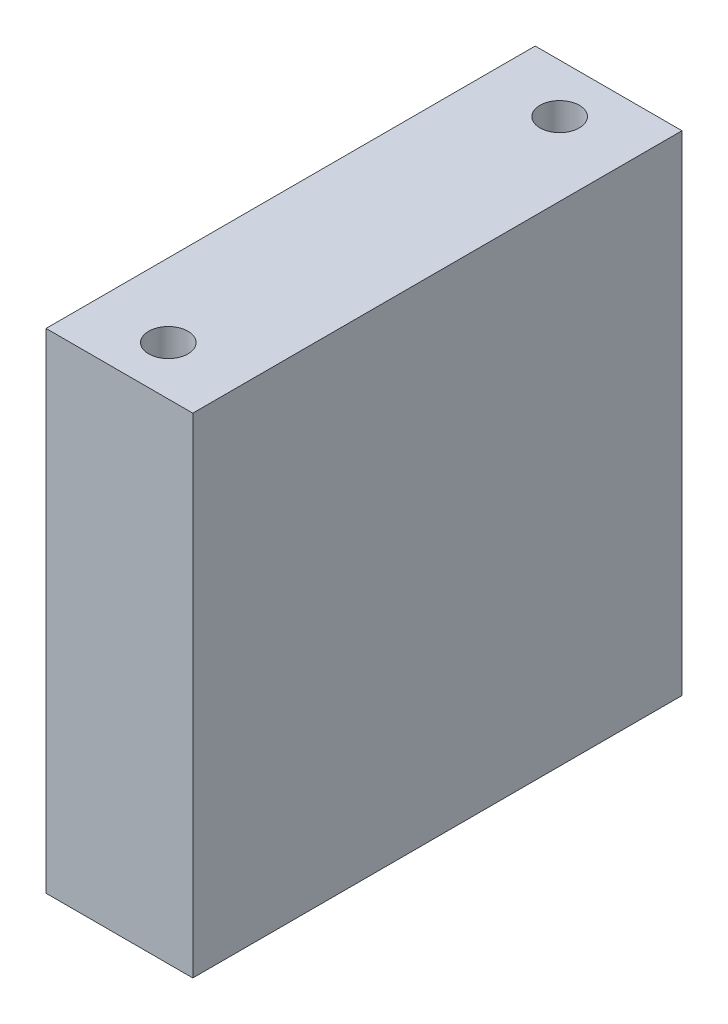
ISO-10303-21;
HEADER;
FILE_DESCRIPTION(('STEP AP214'),'2;1');
FILE_NAME('part.step','',(''),(''),'','','');
FILE_SCHEMA(('AUTOMOTIVE_DESIGN { 1 0 10303 214 1 1 1 1 }'));
ENDSEC;
DATA;
#1=APPLICATION_CONTEXT('core data for automotive mechanical design processes');
#2=APPLICATION_PROTOCOL_DEFINITION('international standard','automotive_design',2000,#1);
#3=PRODUCT_CONTEXT('',#1,'mechanical');
#4=PRODUCT('Part','Part','',(#3));
#5=PRODUCT_RELATED_PRODUCT_CATEGORY('part','',(#4));
#6=PRODUCT_DEFINITION_FORMATION('','',#4);
#7=PRODUCT_DEFINITION_CONTEXT('part definition',#1,'design');
#8=PRODUCT_DEFINITION('design','',#6,#7);
#9=PRODUCT_DEFINITION_SHAPE('','',#8);
#10=(LENGTH_UNIT() NAMED_UNIT(*) SI_UNIT(.MILLI.,.METRE.));
#11=(NAMED_UNIT(*) PLANE_ANGLE_UNIT() SI_UNIT($,.RADIAN.));
#12=(NAMED_UNIT(*) SI_UNIT($,.STERADIAN.) SOLID_ANGLE_UNIT());
#13=UNCERTAINTY_MEASURE_WITH_UNIT(LENGTH_MEASURE(1.E-05),#10,'distance_accuracy_value','');
#14=(GEOMETRIC_REPRESENTATION_CONTEXT(3) GLOBAL_UNCERTAINTY_ASSIGNED_CONTEXT((#13)) GLOBAL_UNIT_ASSIGNED_CONTEXT((#10,
#11,#12)) REPRESENTATION_CONTEXT('',''));
#15=CARTESIAN_POINT('',(0.,0.,0.));
#16=DIRECTION('',(0.,0.,1.));
#17=DIRECTION('',(1.,0.,0.));
#18=AXIS2_PLACEMENT_3D('',#15,#16,#17);
#19=CARTESIAN_POINT('',(-9.525,63.5,31.75));
#20=DIRECTION('',(1.,0.,0.));
#21=DIRECTION('',(0.,0.,-1.));
#22=AXIS2_PLACEMENT_3D('',#19,#20,#21);
#23=PLANE('',#22);
#24=DIRECTION('',(0.,0.,1.));
#25=VECTOR('',#24,1.);
#26=CARTESIAN_POINT('',(-9.525,0.,31.75));
#27=LINE('',#26,#25);
#28=CARTESIAN_POINT('',(-9.525,0.,-31.75));
#29=VERTEX_POINT('',#28);
#30=CARTESIAN_POINT('',(-9.525,0.,31.75));
#31=VERTEX_POINT('',#30);
#32=EDGE_CURVE('E134',#29,#31,#27,.T.);
#33=ORIENTED_EDGE('',*,*,#32,.T.);
#34=DIRECTION('',(0.,-1.,0.));
#35=VECTOR('',#34,1.);
#36=CARTESIAN_POINT('',(-9.525,63.5,31.75));
#37=LINE('',#36,#35);
#38=CARTESIAN_POINT('',(-9.525,63.5,31.75));
#39=VERTEX_POINT('',#38);
#40=EDGE_CURVE('E11',#39,#31,#37,.T.);
#41=ORIENTED_EDGE('',*,*,#40,.F.);
#42=DIRECTION('',(0.,0.,1.));
#43=VECTOR('',#42,1.);
#44=CARTESIAN_POINT('',(-9.525,63.5,31.75));
#45=LINE('',#44,#43);
#46=CARTESIAN_POINT('',(-9.525,63.5,-31.75));
#47=VERTEX_POINT('',#46);
#48=EDGE_CURVE('E135',#47,#39,#45,.T.);
#49=ORIENTED_EDGE('',*,*,#48,.F.);
#50=DIRECTION('',(0.,-1.,0.));
#51=VECTOR('',#50,1.);
#52=CARTESIAN_POINT('',(-9.525,63.5,-31.75));
#53=LINE('',#52,#51);
#54=EDGE_CURVE('E141',#47,#29,#53,.T.);
#55=ORIENTED_EDGE('',*,*,#54,.T.);
#56=EDGE_LOOP('',(#33,#41,#49,#55));
#57=FACE_BOUND('',#56,.T.);
#58=ADVANCED_FACE('F41',(#57),#23,.F.);
#59=CARTESIAN_POINT('',(9.525,63.5,31.75));
#60=DIRECTION('',(0.,0.,-1.));
#61=DIRECTION('',(-1.,0.,0.));
#62=AXIS2_PLACEMENT_3D('',#59,#60,#61);
#63=PLANE('',#62);
#64=DIRECTION('',(1.,0.,0.));
#65=VECTOR('',#64,1.);
#66=CARTESIAN_POINT('',(9.525,0.,31.75));
#67=LINE('',#66,#65);
#68=CARTESIAN_POINT('',(9.525,0.,31.75));
#69=VERTEX_POINT('',#68);
#70=EDGE_CURVE('E144',#31,#69,#67,.T.);
#71=ORIENTED_EDGE('',*,*,#70,.T.);
#72=DIRECTION('',(0.,-1.,0.));
#73=VECTOR('',#72,1.);
#74=CARTESIAN_POINT('',(9.525,63.5,31.75));
#75=LINE('',#74,#73);
#76=CARTESIAN_POINT('',(9.525,63.5,31.75));
#77=VERTEX_POINT('',#76);
#78=EDGE_CURVE('E49',#77,#69,#75,.T.);
#79=ORIENTED_EDGE('',*,*,#78,.F.);
#80=DIRECTION('',(1.,0.,0.));
#81=VECTOR('',#80,1.);
#82=CARTESIAN_POINT('',(9.525,63.5,31.75));
#83=LINE('',#82,#81);
#84=EDGE_CURVE('E88',#39,#77,#83,.T.);
#85=ORIENTED_EDGE('',*,*,#84,.F.);
#86=ORIENTED_EDGE('',*,*,#40,.T.);
#87=EDGE_LOOP('',(#71,#79,#85,#86));
#88=FACE_BOUND('',#87,.T.);
#89=ADVANCED_FACE('F169',(#88),#63,.F.);
#90=CARTESIAN_POINT('',(9.525,63.5,31.75));
#91=DIRECTION('',(-1.,0.,0.));
#92=DIRECTION('',(0.,0.,1.));
#93=AXIS2_PLACEMENT_3D('',#90,#91,#92);
#94=PLANE('',#93);
#95=DIRECTION('',(0.,0.,-1.));
#96=VECTOR('',#95,1.);
#97=CARTESIAN_POINT('',(9.525,0.,31.75));
#98=LINE('',#97,#96);
#99=CARTESIAN_POINT('',(9.525,0.,-31.75));
#100=VERTEX_POINT('',#99);
#101=EDGE_CURVE('E75',#69,#100,#98,.T.);
#102=ORIENTED_EDGE('',*,*,#101,.T.);
#103=DIRECTION('',(0.,-1.,0.));
#104=VECTOR('',#103,1.);
#105=CARTESIAN_POINT('',(9.525,63.5,-31.75));
#106=LINE('',#105,#104);
#107=CARTESIAN_POINT('',(9.525,63.5,-31.75));
#108=VERTEX_POINT('',#107);
#109=EDGE_CURVE('E149',#108,#100,#106,.T.);
#110=ORIENTED_EDGE('',*,*,#109,.F.);
#111=DIRECTION('',(0.,0.,-1.));
#112=VECTOR('',#111,1.);
#113=CARTESIAN_POINT('',(9.525,63.5,31.75));
#114=LINE('',#113,#112);
#115=EDGE_CURVE('E138',#77,#108,#114,.T.);
#116=ORIENTED_EDGE('',*,*,#115,.F.);
#117=ORIENTED_EDGE('',*,*,#78,.T.);
#118=EDGE_LOOP('',(#102,#110,#116,#117));
#119=FACE_BOUND('',#118,.T.);
#120=ADVANCED_FACE('F151',(#119),#94,.F.);
#121=CARTESIAN_POINT('',(9.525,63.5,-31.75));
#122=DIRECTION('',(0.,0.,1.));
#123=DIRECTION('',(1.,0.,0.));
#124=AXIS2_PLACEMENT_3D('',#121,#122,#123);
#125=PLANE('',#124);
#126=DIRECTION('',(-1.,0.,0.));
#127=VECTOR('',#126,1.);
#128=CARTESIAN_POINT('',(9.525,0.,-31.75));
#129=LINE('',#128,#127);
#130=EDGE_CURVE('E81',#100,#29,#129,.T.);
#131=ORIENTED_EDGE('',*,*,#130,.T.);
#132=ORIENTED_EDGE('',*,*,#54,.F.);
#133=DIRECTION('',(-1.,0.,0.));
#134=VECTOR('',#133,1.);
#135=CARTESIAN_POINT('',(9.525,63.5,-31.75));
#136=LINE('',#135,#134);
#137=EDGE_CURVE('E57',#108,#47,#136,.T.);
#138=ORIENTED_EDGE('',*,*,#137,.F.);
#139=ORIENTED_EDGE('',*,*,#109,.T.);
#140=EDGE_LOOP('',(#131,#132,#138,#139));
#141=FACE_BOUND('',#140,.T.);
#142=ADVANCED_FACE('F158',(#141),#125,.F.);
#143=CARTESIAN_POINT('',(0.,63.5,0.));
#144=DIRECTION('',(0.,1.,0.));
#145=DIRECTION('',(0.,0.,1.));
#146=AXIS2_PLACEMENT_3D('',#143,#144,#145);
#147=PLANE('',#146);
#148=CARTESIAN_POINT('',(0.,63.5,-25.4));
#149=DIRECTION('',(0.,1.,0.));
#150=DIRECTION('',(0.,0.,1.));
#151=AXIS2_PLACEMENT_3D('',#148,#149,#150);
#152=CIRCLE('',#151,2.55269999999999);
#153=CARTESIAN_POINT('',(0.,63.5,-22.8473));
#154=VERTEX_POINT('',#153);
#155=EDGE_CURVE('E112',#154,#154,#152,.T.);
#156=ORIENTED_EDGE('',*,*,#155,.F.);
#157=EDGE_LOOP('',(#156));
#158=FACE_BOUND('',#157,.T.);
#159=CARTESIAN_POINT('',(0.,63.5,25.4));
#160=DIRECTION('',(0.,1.,0.));
#161=DIRECTION('',(0.,0.,1.));
#162=AXIS2_PLACEMENT_3D('',#159,#160,#161);
#163=CIRCLE('',#162,2.55269999999999);
#164=CARTESIAN_POINT('',(0.,63.5,27.9527));
#165=VERTEX_POINT('',#164);
#166=EDGE_CURVE('E111',#165,#165,#163,.T.);
#167=ORIENTED_EDGE('',*,*,#166,.F.);
#168=EDGE_LOOP('',(#167));
#169=FACE_BOUND('',#168,.T.);
#170=ORIENTED_EDGE('',*,*,#48,.T.);
#171=ORIENTED_EDGE('',*,*,#84,.T.);
#172=ORIENTED_EDGE('',*,*,#115,.T.);
#173=ORIENTED_EDGE('',*,*,#137,.T.);
#174=EDGE_LOOP('',(#170,#171,#172,#173));
#175=FACE_BOUND('',#174,.T.);
#176=ADVANCED_FACE('F160',(#158,#169,#175),#147,.T.);
#177=CARTESIAN_POINT('',(0.,0.,0.));
#178=DIRECTION('',(0.,1.,0.));
#179=DIRECTION('',(0.,0.,1.));
#180=AXIS2_PLACEMENT_3D('',#177,#178,#179);
#181=PLANE('',#180);
#182=CARTESIAN_POINT('',(0.,0.,25.4));
#183=DIRECTION('',(0.,-1.,0.));
#184=DIRECTION('',(0.,0.,-1.));
#185=AXIS2_PLACEMENT_3D('',#182,#183,#184);
#186=CIRCLE('',#185,2.55269999999999);
#187=CARTESIAN_POINT('',(0.,0.,22.8473));
#188=VERTEX_POINT('',#187);
#189=EDGE_CURVE('E122',#188,#188,#186,.T.);
#190=ORIENTED_EDGE('',*,*,#189,.F.);
#191=EDGE_LOOP('',(#190));
#192=FACE_BOUND('',#191,.T.);
#193=CARTESIAN_POINT('',(0.,0.,-25.4));
#194=DIRECTION('',(0.,-1.,0.));
#195=DIRECTION('',(0.,0.,-1.));
#196=AXIS2_PLACEMENT_3D('',#193,#194,#195);
#197=CIRCLE('',#196,2.55269999999999);
#198=CARTESIAN_POINT('',(0.,0.,-27.9527));
#199=VERTEX_POINT('',#198);
#200=EDGE_CURVE('E128',#199,#199,#197,.T.);
#201=ORIENTED_EDGE('',*,*,#200,.F.);
#202=EDGE_LOOP('',(#201));
#203=FACE_BOUND('',#202,.T.);
#204=ORIENTED_EDGE('',*,*,#32,.F.);
#205=ORIENTED_EDGE('',*,*,#130,.F.);
#206=ORIENTED_EDGE('',*,*,#101,.F.);
#207=ORIENTED_EDGE('',*,*,#70,.F.);
#208=EDGE_LOOP('',(#204,#205,#206,#207));
#209=FACE_BOUND('',#208,.T.);
#210=ADVANCED_FACE('F154',(#192,#203,#209),#181,.F.);
#211=CARTESIAN_POINT('',(0.,16.51,-25.4));
#212=DIRECTION('',(0.,-1.,0.));
#213=DIRECTION('',(0.,0.,-1.));
#214=AXIS2_PLACEMENT_3D('',#211,#212,#213);
#215=CONICAL_SURFACE('',#214,2.55269999999999,1.02974425867665);
#216=CARTESIAN_POINT('',(0.,18.0438169021916,-25.4));
#217=VERTEX_POINT('',#216);
#218=VERTEX_LOOP('',#217);
#219=FACE_BOUND('',#218,.T.);
#220=CARTESIAN_POINT('',(0.,16.51,-25.4));
#221=DIRECTION('',(0.,-1.,0.));
#222=DIRECTION('',(0.,0.,-1.));
#223=AXIS2_PLACEMENT_3D('',#220,#221,#222);
#224=CIRCLE('',#223,2.55269999999999);
#225=CARTESIAN_POINT('',(0.,16.51,-27.9527));
#226=VERTEX_POINT('',#225);
#227=EDGE_CURVE('E131',#226,#226,#224,.T.);
#228=ORIENTED_EDGE('',*,*,#227,.T.);
#229=EDGE_LOOP('',(#228));
#230=FACE_BOUND('',#229,.T.);
#231=ADVANCED_FACE('F197',(#219,#230),#215,.F.);
#232=CARTESIAN_POINT('',(0.,0.,-25.4));
#233=DIRECTION('',(0.,-1.,0.));
#234=DIRECTION('',(0.,0.,-1.));
#235=AXIS2_PLACEMENT_3D('',#232,#233,#234);
#236=CYLINDRICAL_SURFACE('',#235,2.55269999999999);
#237=ORIENTED_EDGE('',*,*,#227,.F.);
#238=EDGE_LOOP('',(#237));
#239=FACE_BOUND('',#238,.T.);
#240=ORIENTED_EDGE('',*,*,#200,.T.);
#241=EDGE_LOOP('',(#240));
#242=FACE_BOUND('',#241,.T.);
#243=ADVANCED_FACE('F208',(#239,#242),#236,.F.);
#244=CARTESIAN_POINT('',(0.,16.51,25.4));
#245=DIRECTION('',(0.,-1.,0.));
#246=DIRECTION('',(0.,0.,-1.));
#247=AXIS2_PLACEMENT_3D('',#244,#245,#246);
#248=CONICAL_SURFACE('',#247,2.55269999999999,1.02974425867665);
#249=CARTESIAN_POINT('',(0.,18.0438169021916,25.4));
#250=VERTEX_POINT('',#249);
#251=VERTEX_LOOP('',#250);
#252=FACE_BOUND('',#251,.T.);
#253=CARTESIAN_POINT('',(0.,16.51,25.4));
#254=DIRECTION('',(0.,-1.,0.));
#255=DIRECTION('',(0.,0.,-1.));
#256=AXIS2_PLACEMENT_3D('',#253,#254,#255);
#257=CIRCLE('',#256,2.55269999999999);
#258=CARTESIAN_POINT('',(0.,16.51,22.8473));
#259=VERTEX_POINT('',#258);
#260=EDGE_CURVE('E125',#259,#259,#257,.T.);
#261=ORIENTED_EDGE('',*,*,#260,.T.);
#262=EDGE_LOOP('',(#261));
#263=FACE_BOUND('',#262,.T.);
#264=ADVANCED_FACE('F220',(#252,#263),#248,.F.);
#265=CARTESIAN_POINT('',(0.,0.,25.4));
#266=DIRECTION('',(0.,-1.,0.));
#267=DIRECTION('',(0.,0.,-1.));
#268=AXIS2_PLACEMENT_3D('',#265,#266,#267);
#269=CYLINDRICAL_SURFACE('',#268,2.55269999999999);
#270=ORIENTED_EDGE('',*,*,#260,.F.);
#271=EDGE_LOOP('',(#270));
#272=FACE_BOUND('',#271,.T.);
#273=ORIENTED_EDGE('',*,*,#189,.T.);
#274=EDGE_LOOP('',(#273));
#275=FACE_BOUND('',#274,.T.);
#276=ADVANCED_FACE('F232',(#272,#275),#269,.F.);
#277=CARTESIAN_POINT('',(0.,46.99,25.4));
#278=DIRECTION('',(0.,1.,0.));
#279=DIRECTION('',(0.,0.,1.));
#280=AXIS2_PLACEMENT_3D('',#277,#278,#279);
#281=CONICAL_SURFACE('',#280,2.55269999999999,1.02974425867665);
#282=CARTESIAN_POINT('',(0.,45.4561830978084,25.4));
#283=VERTEX_POINT('',#282);
#284=VERTEX_LOOP('',#283);
#285=FACE_BOUND('',#284,.T.);
#286=CARTESIAN_POINT('',(0.,46.99,25.4));
#287=DIRECTION('',(0.,1.,0.));
#288=DIRECTION('',(0.,0.,1.));
#289=AXIS2_PLACEMENT_3D('',#286,#287,#288);
#290=CIRCLE('',#289,2.55269999999999);
#291=CARTESIAN_POINT('',(0.,46.99,27.9527));
#292=VERTEX_POINT('',#291);
#293=EDGE_CURVE('E115',#292,#292,#290,.T.);
#294=ORIENTED_EDGE('',*,*,#293,.T.);
#295=EDGE_LOOP('',(#294));
#296=FACE_BOUND('',#295,.T.);
#297=ADVANCED_FACE('F243',(#285,#296),#281,.F.);
#298=CARTESIAN_POINT('',(0.,63.5,25.4));
#299=DIRECTION('',(0.,1.,0.));
#300=DIRECTION('',(0.,0.,1.));
#301=AXIS2_PLACEMENT_3D('',#298,#299,#300);
#302=CYLINDRICAL_SURFACE('',#301,2.55269999999999);
#303=ORIENTED_EDGE('',*,*,#293,.F.);
#304=EDGE_LOOP('',(#303));
#305=FACE_BOUND('',#304,.T.);
#306=ORIENTED_EDGE('',*,*,#166,.T.);
#307=EDGE_LOOP('',(#306));
#308=FACE_BOUND('',#307,.T.);
#309=ADVANCED_FACE('F105',(#305,#308),#302,.F.);
#310=CARTESIAN_POINT('',(0.,46.99,-25.4));
#311=DIRECTION('',(0.,1.,0.));
#312=DIRECTION('',(0.,0.,1.));
#313=AXIS2_PLACEMENT_3D('',#310,#311,#312);
#314=CONICAL_SURFACE('',#313,2.55269999999999,1.02974425867665);
#315=CARTESIAN_POINT('',(0.,45.4561830978084,-25.4));
#316=VERTEX_POINT('',#315);
#317=VERTEX_LOOP('',#316);
#318=FACE_BOUND('',#317,.T.);
#319=CARTESIAN_POINT('',(0.,46.99,-25.4));
#320=DIRECTION('',(0.,1.,0.));
#321=DIRECTION('',(0.,0.,1.));
#322=AXIS2_PLACEMENT_3D('',#319,#320,#321);
#323=CIRCLE('',#322,2.55269999999999);
#324=CARTESIAN_POINT('',(0.,46.99,-22.8473));
#325=VERTEX_POINT('',#324);
#326=EDGE_CURVE('E109',#325,#325,#323,.T.);
#327=ORIENTED_EDGE('',*,*,#326,.T.);
#328=EDGE_LOOP('',(#327));
#329=FACE_BOUND('',#328,.T.);
#330=ADVANCED_FACE('F101',(#318,#329),#314,.F.);
#331=CARTESIAN_POINT('',(0.,63.5,-25.4));
#332=DIRECTION('',(0.,1.,0.));
#333=DIRECTION('',(0.,0.,1.));
#334=AXIS2_PLACEMENT_3D('',#331,#332,#333);
#335=CYLINDRICAL_SURFACE('',#334,2.55269999999999);
#336=ORIENTED_EDGE('',*,*,#326,.F.);
#337=EDGE_LOOP('',(#336));
#338=FACE_BOUND('',#337,.T.);
#339=ORIENTED_EDGE('',*,*,#155,.T.);
#340=EDGE_LOOP('',(#339));
#341=FACE_BOUND('',#340,.T.);
#342=ADVANCED_FACE('F104',(#338,#341),#335,.F.);
#343=CLOSED_SHELL('',(#58,#89,#120,#142,#176,#210,#231,#243,#264,#276,#297,#309,#330,#342));
#344=MANIFOLD_SOLID_BREP('B2',#343);
#345=ADVANCED_BREP_SHAPE_REPRESENTATION('',(#18,#344),#14);
#346=SHAPE_DEFINITION_REPRESENTATION(#9,#345);
ENDSEC;
END-ISO-10303-21;
